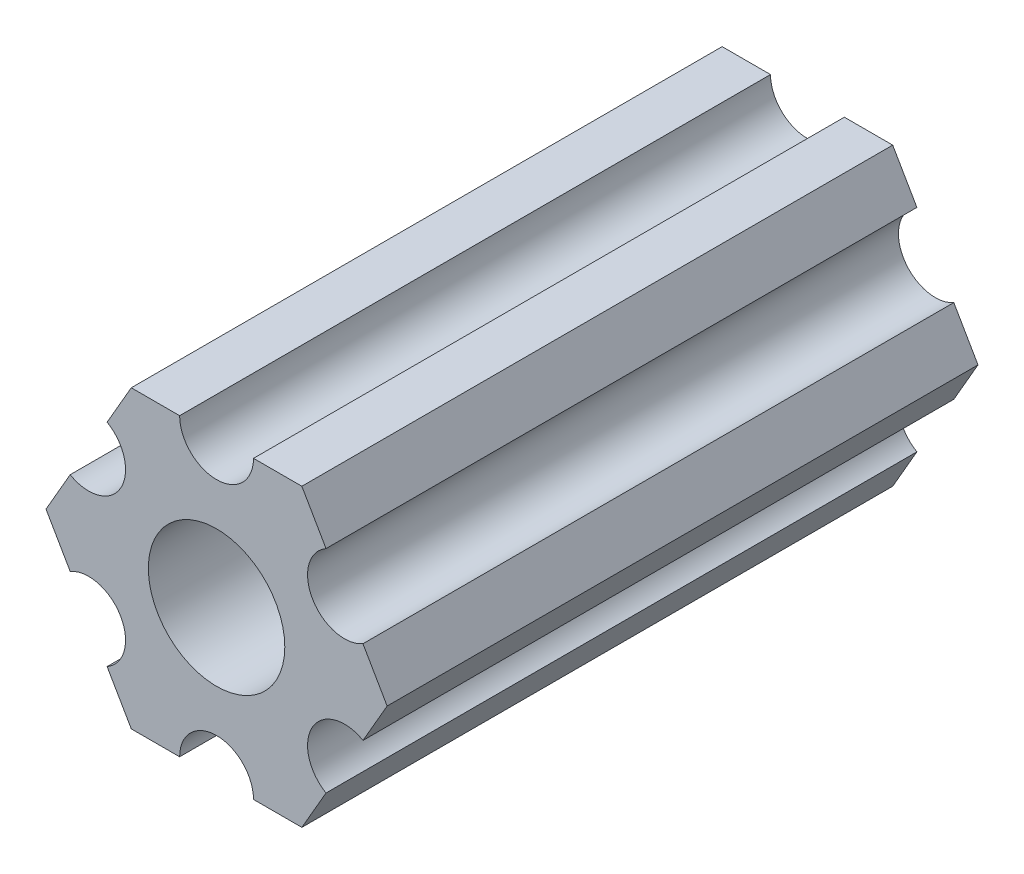
ISO-10303-21;
HEADER;
FILE_DESCRIPTION(('STEP AP214'),'2;1');
FILE_NAME('part.step','',(''),(''),'','','');
FILE_SCHEMA(('AUTOMOTIVE_DESIGN { 1 0 10303 214 1 1 1 1 }'));
ENDSEC;
DATA;
#1=APPLICATION_CONTEXT('core data for automotive mechanical design processes');
#2=APPLICATION_PROTOCOL_DEFINITION('international standard','automotive_design',2000,#1);
#3=PRODUCT_CONTEXT('',#1,'mechanical');
#4=PRODUCT('Part','Part','',(#3));
#5=PRODUCT_RELATED_PRODUCT_CATEGORY('part','',(#4));
#6=PRODUCT_DEFINITION_FORMATION('','',#4);
#7=PRODUCT_DEFINITION_CONTEXT('part definition',#1,'design');
#8=PRODUCT_DEFINITION('design','',#6,#7);
#9=PRODUCT_DEFINITION_SHAPE('','',#8);
#10=(LENGTH_UNIT() NAMED_UNIT(*) SI_UNIT(.MILLI.,.METRE.));
#11=(NAMED_UNIT(*) PLANE_ANGLE_UNIT() SI_UNIT($,.RADIAN.));
#12=(NAMED_UNIT(*) SI_UNIT($,.STERADIAN.) SOLID_ANGLE_UNIT());
#13=UNCERTAINTY_MEASURE_WITH_UNIT(LENGTH_MEASURE(1.E-05),#10,'distance_accuracy_value','');
#14=(GEOMETRIC_REPRESENTATION_CONTEXT(3) GLOBAL_UNCERTAINTY_ASSIGNED_CONTEXT((#13)) GLOBAL_UNIT_ASSIGNED_CONTEXT((#10,
#11,#12)) REPRESENTATION_CONTEXT('',''));
#15=CARTESIAN_POINT('',(0.,0.,0.));
#16=DIRECTION('',(0.,0.,1.));
#17=DIRECTION('',(1.,0.,0.));
#18=AXIS2_PLACEMENT_3D('',#15,#16,#17);
#19=CARTESIAN_POINT('',(5.49926150638083,-3.17499966684068,12.7));
#20=DIRECTION('',(0.,0.,-1.));
#21=DIRECTION('',(-1.,0.,0.));
#22=AXIS2_PLACEMENT_3D('',#19,#20,#21);
#23=CYLINDRICAL_SURFACE('',#22,1.58750000000001);
#24=CARTESIAN_POINT('',(5.49926150638083,-3.17499966684068,-12.7));
#25=DIRECTION('',(0.,0.,1.));
#26=DIRECTION('',(1.,0.,0.));
#27=AXIS2_PLACEMENT_3D('',#24,#25,#26);
#28=CIRCLE('',#27,1.58750000000001);
#29=CARTESIAN_POINT('',(6.29301142309098,-1.80018429024546,-12.7));
#30=VERTEX_POINT('',#29);
#31=CARTESIAN_POINT('',(4.70551158967068,-4.54981504343589,-12.7));
#32=VERTEX_POINT('',#31);
#33=EDGE_CURVE('E189',#30,#32,#28,.T.);
#34=ORIENTED_EDGE('',*,*,#33,.F.);
#35=DIRECTION('',(0.,0.,-1.));
#36=VECTOR('',#35,1.);
#37=CARTESIAN_POINT('',(6.29301142309098,-1.80018429024546,12.7));
#38=LINE('',#37,#36);
#39=CARTESIAN_POINT('',(6.29301142309098,-1.80018429024546,12.7));
#40=VERTEX_POINT('',#39);
#41=EDGE_CURVE('E11',#40,#30,#38,.T.);
#42=ORIENTED_EDGE('',*,*,#41,.F.);
#43=CARTESIAN_POINT('',(5.49926150638083,-3.17499966684068,12.7));
#44=DIRECTION('',(0.,0.,1.));
#45=DIRECTION('',(1.,0.,0.));
#46=AXIS2_PLACEMENT_3D('',#43,#44,#45);
#47=CIRCLE('',#46,1.58750000000001);
#48=CARTESIAN_POINT('',(4.70551158967068,-4.54981504343589,12.7));
#49=VERTEX_POINT('',#48);
#50=EDGE_CURVE('E240',#40,#49,#47,.T.);
#51=ORIENTED_EDGE('',*,*,#50,.T.);
#52=DIRECTION('',(0.,0.,-1.));
#53=VECTOR('',#52,1.);
#54=CARTESIAN_POINT('',(4.70551158967068,-4.54981504343589,12.7));
#55=LINE('',#54,#53);
#56=EDGE_CURVE('E35',#49,#32,#55,.T.);
#57=ORIENTED_EDGE('',*,*,#56,.T.);
#58=EDGE_LOOP('',(#34,#42,#51,#57));
#59=FACE_BOUND('',#58,.T.);
#60=ADVANCED_FACE('F32',(#59),#23,.F.);
#61=CARTESIAN_POINT('',(7.33234841870826,4.44212518856872E-07,12.7));
#62=DIRECTION('',(0.866025434075723,-0.499999947533953,0.));
#63=DIRECTION('',(0.499999947533953,0.866025434075723,0.));
#64=AXIS2_PLACEMENT_3D('',#61,#62,#63);
#65=PLANE('',#64);
#66=DIRECTION('',(-0.499999947533953,-0.866025434075723,0.));
#67=VECTOR('',#66,1.);
#68=CARTESIAN_POINT('',(7.33234841870826,4.44212518856872E-07,-12.7));
#69=LINE('',#68,#67);
#70=CARTESIAN_POINT('',(7.33234841870826,4.44212518856872E-07,-12.7));
#71=VERTEX_POINT('',#70);
#72=EDGE_CURVE('E238',#71,#30,#69,.T.);
#73=ORIENTED_EDGE('',*,*,#72,.F.);
#74=DIRECTION('',(0.,0.,-1.));
#75=VECTOR('',#74,1.);
#76=CARTESIAN_POINT('',(7.33234841870826,4.44212518856872E-07,12.7));
#77=LINE('',#76,#75);
#78=CARTESIAN_POINT('',(7.33234841870826,4.44212518856872E-07,12.7));
#79=VERTEX_POINT('',#78);
#80=EDGE_CURVE('E41',#79,#71,#77,.T.);
#81=ORIENTED_EDGE('',*,*,#80,.F.);
#82=DIRECTION('',(-0.499999947533953,-0.866025434075723,0.));
#83=VECTOR('',#82,1.);
#84=CARTESIAN_POINT('',(7.33234841870826,4.44212518856872E-07,12.7));
#85=LINE('',#84,#83);
#86=EDGE_CURVE('E179',#79,#40,#85,.T.);
#87=ORIENTED_EDGE('',*,*,#86,.T.);
#88=ORIENTED_EDGE('',*,*,#41,.T.);
#89=EDGE_LOOP('',(#73,#81,#87,#88));
#90=FACE_BOUND('',#89,.T.);
#91=ADVANCED_FACE('F272',(#90),#65,.T.);
#92=CARTESIAN_POINT('',(6.29301120497139,1.80018505273895,12.7));
#93=DIRECTION('',(0.866025373493145,0.500000052466056,0.));
#94=DIRECTION('',(-0.500000052466056,0.866025373493145,0.));
#95=AXIS2_PLACEMENT_3D('',#92,#93,#94);
#96=PLANE('',#95);
#97=DIRECTION('',(0.500000052466056,-0.866025373493145,0.));
#98=VECTOR('',#97,1.);
#99=CARTESIAN_POINT('',(6.29301120497139,1.80018505273895,-12.7));
#100=LINE('',#99,#98);
#101=CARTESIAN_POINT('',(6.29301120497139,1.80018505273895,-12.7));
#102=VERTEX_POINT('',#101);
#103=EDGE_CURVE('E166',#102,#71,#100,.T.);
#104=ORIENTED_EDGE('',*,*,#103,.F.);
#105=DIRECTION('',(0.,0.,-1.));
#106=VECTOR('',#105,1.);
#107=CARTESIAN_POINT('',(6.29301120497139,1.80018505273895,12.7));
#108=LINE('',#107,#106);
#109=CARTESIAN_POINT('',(6.29301120497139,1.80018505273895,12.7));
#110=VERTEX_POINT('',#109);
#111=EDGE_CURVE('E161',#110,#102,#108,.T.);
#112=ORIENTED_EDGE('',*,*,#111,.F.);
#113=DIRECTION('',(0.500000052466056,-0.866025373493145,0.));
#114=VECTOR('',#113,1.);
#115=CARTESIAN_POINT('',(6.29301120497139,1.80018505273895,12.7));
#116=LINE('',#115,#114);
#117=EDGE_CURVE('E164',#110,#79,#116,.T.);
#118=ORIENTED_EDGE('',*,*,#117,.T.);
#119=ORIENTED_EDGE('',*,*,#80,.T.);
#120=EDGE_LOOP('',(#104,#112,#118,#119));
#121=FACE_BOUND('',#120,.T.);
#122=ADVANCED_FACE('F163',(#121),#96,.T.);
#123=CARTESIAN_POINT('',(5.49926112168152,3.17500033315931,12.7));
#124=DIRECTION('',(0.,0.,-1.));
#125=DIRECTION('',(-1.,0.,0.));
#126=AXIS2_PLACEMENT_3D('',#123,#124,#125);
#127=CYLINDRICAL_SURFACE('',#126,1.5875);
#128=CARTESIAN_POINT('',(5.49926112168152,3.17500033315931,-12.7));
#129=DIRECTION('',(0.,0.,1.));
#130=DIRECTION('',(1.,0.,0.));
#131=AXIS2_PLACEMENT_3D('',#128,#129,#130);
#132=CIRCLE('',#131,1.5875);
#133=CARTESIAN_POINT('',(4.70551103839166,4.54981561357968,-12.7));
#134=VERTEX_POINT('',#133);
#135=EDGE_CURVE('E235',#134,#102,#132,.T.);
#136=ORIENTED_EDGE('',*,*,#135,.F.);
#137=DIRECTION('',(0.,0.,-1.));
#138=VECTOR('',#137,1.);
#139=CARTESIAN_POINT('',(4.70551103839166,4.54981561357968,12.7));
#140=LINE('',#139,#138);
#141=CARTESIAN_POINT('',(4.70551103839166,4.54981561357968,12.7));
#142=VERTEX_POINT('',#141);
#143=EDGE_CURVE('E171',#142,#134,#140,.T.);
#144=ORIENTED_EDGE('',*,*,#143,.F.);
#145=CARTESIAN_POINT('',(5.49926112168152,3.17500033315931,12.7));
#146=DIRECTION('',(0.,0.,1.));
#147=DIRECTION('',(1.,0.,0.));
#148=AXIS2_PLACEMENT_3D('',#145,#146,#147);
#149=CIRCLE('',#148,1.5875);
#150=EDGE_CURVE('E177',#142,#110,#149,.T.);
#151=ORIENTED_EDGE('',*,*,#150,.T.);
#152=ORIENTED_EDGE('',*,*,#111,.T.);
#153=EDGE_LOOP('',(#136,#144,#151,#152));
#154=FACE_BOUND('',#153,.T.);
#155=ADVANCED_FACE('F181',(#154),#127,.F.);
#156=CARTESIAN_POINT('',(3.66617382465472,6.35000022210622,12.7));
#157=DIRECTION('',(0.866025373493145,0.500000052466056,0.));
#158=DIRECTION('',(-0.500000052466056,0.866025373493145,0.));
#159=AXIS2_PLACEMENT_3D('',#156,#157,#158);
#160=PLANE('',#159);
#161=DIRECTION('',(0.500000052466056,-0.866025373493145,0.));
#162=VECTOR('',#161,1.);
#163=CARTESIAN_POINT('',(3.66617382465472,6.35000022210622,-12.7));
#164=LINE('',#163,#162);
#165=CARTESIAN_POINT('',(3.66617382465472,6.35000022210622,-12.7));
#166=VERTEX_POINT('',#165);
#167=EDGE_CURVE('E232',#166,#134,#164,.T.);
#168=ORIENTED_EDGE('',*,*,#167,.F.);
#169=DIRECTION('',(0.,0.,-1.));
#170=VECTOR('',#169,1.);
#171=CARTESIAN_POINT('',(3.66617382465472,6.35000022210622,12.7));
#172=LINE('',#171,#170);
#173=CARTESIAN_POINT('',(3.66617382465472,6.35000022210622,12.7));
#174=VERTEX_POINT('',#173);
#175=EDGE_CURVE('E244',#174,#166,#172,.T.);
#176=ORIENTED_EDGE('',*,*,#175,.F.);
#177=DIRECTION('',(0.500000052466056,-0.866025373493145,0.));
#178=VECTOR('',#177,1.);
#179=CARTESIAN_POINT('',(3.66617382465472,6.35000022210622,12.7));
#180=LINE('',#179,#178);
#181=EDGE_CURVE('E182',#174,#142,#180,.T.);
#182=ORIENTED_EDGE('',*,*,#181,.T.);
#183=ORIENTED_EDGE('',*,*,#143,.T.);
#184=EDGE_LOOP('',(#168,#176,#182,#183));
#185=FACE_BOUND('',#184,.T.);
#186=ADVANCED_FACE('F285',(#185),#160,.T.);
#187=CARTESIAN_POINT('',(1.58749961530066,6.35000022210623,12.7));
#188=DIRECTION('',(0.,1.,0.));
#189=DIRECTION('',(-1.,0.,0.));
#190=AXIS2_PLACEMENT_3D('',#187,#188,#189);
#191=PLANE('',#190);
#192=DIRECTION('',(1.,0.,0.));
#193=VECTOR('',#192,1.);
#194=CARTESIAN_POINT('',(1.58749961530066,6.35000022210623,-12.7));
#195=LINE('',#194,#193);
#196=CARTESIAN_POINT('',(1.58749961530066,6.35000022210623,-12.7));
#197=VERTEX_POINT('',#196);
#198=EDGE_CURVE('E229',#197,#166,#195,.T.);
#199=ORIENTED_EDGE('',*,*,#198,.F.);
#200=DIRECTION('',(0.,0.,-1.));
#201=VECTOR('',#200,1.);
#202=CARTESIAN_POINT('',(1.58749961530066,6.35000022210623,12.7));
#203=LINE('',#202,#201);
#204=CARTESIAN_POINT('',(1.58749961530066,6.35000022210623,12.7));
#205=VERTEX_POINT('',#204);
#206=EDGE_CURVE('E246',#205,#197,#203,.T.);
#207=ORIENTED_EDGE('',*,*,#206,.F.);
#208=DIRECTION('',(1.,0.,0.));
#209=VECTOR('',#208,1.);
#210=CARTESIAN_POINT('',(1.58749961530066,6.35000022210623,12.7));
#211=LINE('',#210,#209);
#212=EDGE_CURVE('E184',#205,#174,#211,.T.);
#213=ORIENTED_EDGE('',*,*,#212,.T.);
#214=ORIENTED_EDGE('',*,*,#175,.T.);
#215=EDGE_LOOP('',(#199,#207,#213,#214));
#216=FACE_BOUND('',#215,.T.);
#217=ADVANCED_FACE('F288',(#216),#191,.T.);
#218=CARTESIAN_POINT('',(-3.84699344941095E-07,6.35000022210623,12.7));
#219=DIRECTION('',(0.,0.,-1.));
#220=DIRECTION('',(-1.,0.,0.));
#221=AXIS2_PLACEMENT_3D('',#218,#219,#220);
#222=CYLINDRICAL_SURFACE('',#221,1.5875);
#223=CARTESIAN_POINT('',(-3.84699344941095E-07,6.35000022210623,-12.7));
#224=DIRECTION('',(0.,0.,1.));
#225=DIRECTION('',(1.,0.,0.));
#226=AXIS2_PLACEMENT_3D('',#223,#224,#225);
#227=CIRCLE('',#226,1.5875);
#228=CARTESIAN_POINT('',(-1.58750038469935,6.35000022210623,-12.7));
#229=VERTEX_POINT('',#228);
#230=EDGE_CURVE('E226',#229,#197,#227,.T.);
#231=ORIENTED_EDGE('',*,*,#230,.F.);
#232=DIRECTION('',(0.,0.,-1.));
#233=VECTOR('',#232,1.);
#234=CARTESIAN_POINT('',(-1.58750038469935,6.35000022210623,12.7));
#235=LINE('',#234,#233);
#236=CARTESIAN_POINT('',(-1.58750038469935,6.35000022210623,12.7));
#237=VERTEX_POINT('',#236);
#238=EDGE_CURVE('E248',#237,#229,#235,.T.);
#239=ORIENTED_EDGE('',*,*,#238,.F.);
#240=CARTESIAN_POINT('',(-3.84699344941095E-07,6.35000022210623,12.7));
#241=DIRECTION('',(0.,0.,1.));
#242=DIRECTION('',(1.,0.,0.));
#243=AXIS2_PLACEMENT_3D('',#240,#241,#242);
#244=CIRCLE('',#243,1.5875);
#245=EDGE_CURVE('E393',#237,#205,#244,.T.);
#246=ORIENTED_EDGE('',*,*,#245,.T.);
#247=ORIENTED_EDGE('',*,*,#206,.T.);
#248=EDGE_LOOP('',(#231,#239,#246,#247));
#249=FACE_BOUND('',#248,.T.);
#250=ADVANCED_FACE('F292',(#249),#222,.F.);
#251=CARTESIAN_POINT('',(-3.66617452134701,6.35000022210623,12.7));
#252=DIRECTION('',(0.,1.,0.));
#253=DIRECTION('',(0.,0.,1.));
#254=AXIS2_PLACEMENT_3D('',#251,#252,#253);
#255=PLANE('',#254);
#256=DIRECTION('',(1.,0.,0.));
#257=VECTOR('',#256,1.);
#258=CARTESIAN_POINT('',(-3.66617452134701,6.35000022210623,-12.7));
#259=LINE('',#258,#257);
#260=CARTESIAN_POINT('',(-3.66617452134701,6.35000022210623,-12.7));
#261=VERTEX_POINT('',#260);
#262=EDGE_CURVE('E223',#261,#229,#259,.T.);
#263=ORIENTED_EDGE('',*,*,#262,.F.);
#264=DIRECTION('',(0.,0.,-1.));
#265=VECTOR('',#264,1.);
#266=CARTESIAN_POINT('',(-3.66617452134701,6.35000022210623,12.7));
#267=LINE('',#266,#265);
#268=CARTESIAN_POINT('',(-3.66617452134701,6.35000022210623,12.7));
#269=VERTEX_POINT('',#268);
#270=EDGE_CURVE('E250',#269,#261,#267,.T.);
#271=ORIENTED_EDGE('',*,*,#270,.F.);
#272=DIRECTION('',(1.,0.,0.));
#273=VECTOR('',#272,1.);
#274=CARTESIAN_POINT('',(-3.66617452134701,6.35000022210623,12.7));
#275=LINE('',#274,#273);
#276=EDGE_CURVE('E390',#269,#237,#275,.T.);
#277=ORIENTED_EDGE('',*,*,#276,.T.);
#278=ORIENTED_EDGE('',*,*,#238,.T.);
#279=EDGE_LOOP('',(#263,#271,#277,#278));
#280=FACE_BOUND('',#279,.T.);
#281=ADVANCED_FACE('F296',(#280),#255,.T.);
#282=CARTESIAN_POINT('',(-4.70551145677116,4.54981548085265,12.7));
#283=DIRECTION('',(-0.866025447431971,0.499999924400249,0.));
#284=DIRECTION('',(-0.499999924400249,-0.866025447431971,0.));
#285=AXIS2_PLACEMENT_3D('',#282,#283,#284);
#286=PLANE('',#285);
#287=DIRECTION('',(0.499999924400249,0.866025447431971,0.));
#288=VECTOR('',#287,1.);
#289=CARTESIAN_POINT('',(-4.70551145677116,4.54981548085265,-12.7));
#290=LINE('',#289,#288);
#291=CARTESIAN_POINT('',(-4.70551145677116,4.54981548085265,-12.7));
#292=VERTEX_POINT('',#291);
#293=EDGE_CURVE('E220',#292,#261,#290,.T.);
#294=ORIENTED_EDGE('',*,*,#293,.F.);
#295=DIRECTION('',(0.,0.,-1.));
#296=VECTOR('',#295,1.);
#297=CARTESIAN_POINT('',(-4.70551145677116,4.54981548085265,12.7));
#298=LINE('',#297,#296);
#299=CARTESIAN_POINT('',(-4.70551145677116,4.54981548085265,12.7));
#300=VERTEX_POINT('',#299);
#301=EDGE_CURVE('E252',#300,#292,#298,.T.);
#302=ORIENTED_EDGE('',*,*,#301,.F.);
#303=DIRECTION('',(0.499999924400249,0.866025447431971,0.));
#304=VECTOR('',#303,1.);
#305=CARTESIAN_POINT('',(-4.70551145677116,4.54981548085265,12.7));
#306=LINE('',#305,#304);
#307=EDGE_CURVE('E387',#300,#269,#306,.T.);
#308=ORIENTED_EDGE('',*,*,#307,.T.);
#309=ORIENTED_EDGE('',*,*,#270,.T.);
#310=EDGE_LOOP('',(#294,#302,#308,#309));
#311=FACE_BOUND('',#310,.T.);
#312=ADVANCED_FACE('F300',(#311),#286,.T.);
#313=CARTESIAN_POINT('',(-5.49926133675655,3.17500008305439,12.7));
#314=DIRECTION('',(0.,0.,-1.));
#315=DIRECTION('',(-1.,0.,0.));
#316=AXIS2_PLACEMENT_3D('',#313,#314,#315);
#317=CYLINDRICAL_SURFACE('',#316,1.5875);
#318=CARTESIAN_POINT('',(-5.49926133675655,3.17500008305439,-12.7));
#319=DIRECTION('',(0.,0.,1.));
#320=DIRECTION('',(1.,0.,0.));
#321=AXIS2_PLACEMENT_3D('',#318,#319,#320);
#322=CIRCLE('',#321,1.5875);
#323=CARTESIAN_POINT('',(-6.29301121674195,1.80018468525613,-12.7));
#324=VERTEX_POINT('',#323);
#325=EDGE_CURVE('E217',#324,#292,#322,.T.);
#326=ORIENTED_EDGE('',*,*,#325,.F.);
#327=DIRECTION('',(0.,0.,-1.));
#328=VECTOR('',#327,1.);
#329=CARTESIAN_POINT('',(-6.29301121674195,1.80018468525613,12.7));
#330=LINE('',#329,#328);
#331=CARTESIAN_POINT('',(-6.29301121674195,1.80018468525613,12.7));
#332=VERTEX_POINT('',#331);
#333=EDGE_CURVE('E254',#332,#324,#330,.T.);
#334=ORIENTED_EDGE('',*,*,#333,.F.);
#335=CARTESIAN_POINT('',(-5.49926133675655,3.17500008305439,12.7));
#336=DIRECTION('',(0.,0.,1.));
#337=DIRECTION('',(1.,0.,0.));
#338=AXIS2_PLACEMENT_3D('',#335,#336,#337);
#339=CIRCLE('',#338,1.5875);
#340=EDGE_CURVE('E384',#332,#300,#339,.T.);
#341=ORIENTED_EDGE('',*,*,#340,.T.);
#342=ORIENTED_EDGE('',*,*,#301,.T.);
#343=EDGE_LOOP('',(#326,#334,#341,#342));
#344=FACE_BOUND('',#343,.T.);
#345=ADVANCED_FACE('F304',(#344),#317,.F.);
#346=CARTESIAN_POINT('',(-7.33234807945963,6.99338729030344E-08,12.7));
#347=DIRECTION('',(-0.866025447431971,0.499999924400249,0.));
#348=DIRECTION('',(-0.499999924400249,-0.866025447431971,0.));
#349=AXIS2_PLACEMENT_3D('',#346,#347,#348);
#350=PLANE('',#349);
#351=DIRECTION('',(0.499999924400249,0.866025447431971,0.));
#352=VECTOR('',#351,1.);
#353=CARTESIAN_POINT('',(-7.33234807945963,6.99338729030344E-08,-12.7));
#354=LINE('',#353,#352);
#355=CARTESIAN_POINT('',(-7.33234807945963,6.99338729030344E-08,-12.7));
#356=VERTEX_POINT('',#355);
#357=EDGE_CURVE('E214',#356,#324,#354,.T.);
#358=ORIENTED_EDGE('',*,*,#357,.F.);
#359=DIRECTION('',(0.,0.,-1.));
#360=VECTOR('',#359,1.);
#361=CARTESIAN_POINT('',(-7.33234807945963,6.99338729030344E-08,12.7));
#362=LINE('',#361,#360);
#363=CARTESIAN_POINT('',(-7.33234807945963,6.99338729030344E-08,12.7));
#364=VERTEX_POINT('',#363);
#365=EDGE_CURVE('E256',#364,#356,#362,.T.);
#366=ORIENTED_EDGE('',*,*,#365,.F.);
#367=DIRECTION('',(0.499999924400249,0.866025447431971,0.));
#368=VECTOR('',#367,1.);
#369=CARTESIAN_POINT('',(-7.33234807945963,6.99338729030344E-08,12.7));
#370=LINE('',#369,#368);
#371=EDGE_CURVE('E381',#364,#332,#370,.T.);
#372=ORIENTED_EDGE('',*,*,#371,.T.);
#373=ORIENTED_EDGE('',*,*,#333,.T.);
#374=EDGE_LOOP('',(#358,#366,#372,#373));
#375=FACE_BOUND('',#374,.T.);
#376=ADVANCED_FACE('F308',(#375),#350,.T.);
#377=CARTESIAN_POINT('',(-6.29301096189761,-1.80018459411914,12.7));
#378=DIRECTION('',(-0.866025400205645,-0.500000006198653,0.));
#379=DIRECTION('',(0.500000006198653,-0.866025400205645,0.));
#380=AXIS2_PLACEMENT_3D('',#377,#378,#379);
#381=PLANE('',#380);
#382=DIRECTION('',(-0.500000006198653,0.866025400205645,0.));
#383=VECTOR('',#382,1.);
#384=CARTESIAN_POINT('',(-6.29301096189761,-1.80018459411914,-12.7));
#385=LINE('',#384,#383);
#386=CARTESIAN_POINT('',(-6.29301096189761,-1.80018459411914,-12.7));
#387=VERTEX_POINT('',#386);
#388=EDGE_CURVE('E211',#387,#356,#385,.T.);
#389=ORIENTED_EDGE('',*,*,#388,.F.);
#390=DIRECTION('',(0.,0.,-1.));
#391=VECTOR('',#390,1.);
#392=CARTESIAN_POINT('',(-6.29301096189761,-1.80018459411914,12.7));
#393=LINE('',#392,#391);
#394=CARTESIAN_POINT('',(-6.29301096189761,-1.80018459411914,12.7));
#395=VERTEX_POINT('',#394);
#396=EDGE_CURVE('E258',#395,#387,#393,.T.);
#397=ORIENTED_EDGE('',*,*,#396,.F.);
#398=DIRECTION('',(-0.500000006198653,0.866025400205645,0.));
#399=VECTOR('',#398,1.);
#400=CARTESIAN_POINT('',(-6.29301096189761,-1.80018459411914,12.7));
#401=LINE('',#400,#399);
#402=EDGE_CURVE('E378',#395,#364,#401,.T.);
#403=ORIENTED_EDGE('',*,*,#402,.T.);
#404=ORIENTED_EDGE('',*,*,#365,.T.);
#405=EDGE_LOOP('',(#389,#397,#403,#404));
#406=FACE_BOUND('',#405,.T.);
#407=ADVANCED_FACE('F312',(#406),#381,.T.);
#408=CARTESIAN_POINT('',(-5.49926095205725,-3.1749999169456,12.7));
#409=DIRECTION('',(0.,0.,-1.));
#410=DIRECTION('',(-1.,0.,0.));
#411=AXIS2_PLACEMENT_3D('',#408,#409,#410);
#412=CYLINDRICAL_SURFACE('',#411,1.5875);
#413=CARTESIAN_POINT('',(-5.49926095205725,-3.1749999169456,-12.7));
#414=DIRECTION('',(0.,0.,1.));
#415=DIRECTION('',(1.,0.,0.));
#416=AXIS2_PLACEMENT_3D('',#413,#414,#415);
#417=CIRCLE('',#416,1.5875);
#418=CARTESIAN_POINT('',(-4.70551094221689,-4.54981523977206,-12.7));
#419=VERTEX_POINT('',#418);
#420=EDGE_CURVE('E208',#419,#387,#417,.T.);
#421=ORIENTED_EDGE('',*,*,#420,.F.);
#422=DIRECTION('',(0.,0.,-1.));
#423=VECTOR('',#422,1.);
#424=CARTESIAN_POINT('',(-4.70551094221689,-4.54981523977206,12.7));
#425=LINE('',#424,#423);
#426=CARTESIAN_POINT('',(-4.70551094221689,-4.54981523977206,12.7));
#427=VERTEX_POINT('',#426);
#428=EDGE_CURVE('E260',#427,#419,#425,.T.);
#429=ORIENTED_EDGE('',*,*,#428,.F.);
#430=CARTESIAN_POINT('',(-5.49926095205725,-3.1749999169456,12.7));
#431=DIRECTION('',(0.,0.,1.));
#432=DIRECTION('',(1.,0.,0.));
#433=AXIS2_PLACEMENT_3D('',#430,#431,#432);
#434=CIRCLE('',#433,1.5875);
#435=EDGE_CURVE('E375',#427,#395,#434,.T.);
#436=ORIENTED_EDGE('',*,*,#435,.T.);
#437=ORIENTED_EDGE('',*,*,#396,.T.);
#438=EDGE_LOOP('',(#421,#429,#436,#437));
#439=FACE_BOUND('',#438,.T.);
#440=ADVANCED_FACE('F316',(#439),#412,.F.);
#441=CARTESIAN_POINT('',(-3.66617382465481,-6.34999990382519,12.7));
#442=DIRECTION('',(-0.866025400205644,-0.500000006198653,0.));
#443=DIRECTION('',(0.500000006198653,-0.866025400205645,0.));
#444=AXIS2_PLACEMENT_3D('',#441,#442,#443);
#445=PLANE('',#444);
#446=DIRECTION('',(-0.500000006198653,0.866025400205644,0.));
#447=VECTOR('',#446,1.);
#448=CARTESIAN_POINT('',(-3.66617382465481,-6.34999990382519,-12.7));
#449=LINE('',#448,#447);
#450=CARTESIAN_POINT('',(-3.66617382465481,-6.34999990382519,-12.7));
#451=VERTEX_POINT('',#450);
#452=EDGE_CURVE('E205',#451,#419,#449,.T.);
#453=ORIENTED_EDGE('',*,*,#452,.F.);
#454=DIRECTION('',(0.,0.,-1.));
#455=VECTOR('',#454,1.);
#456=CARTESIAN_POINT('',(-3.66617382465481,-6.34999990382519,12.7));
#457=LINE('',#456,#455);
#458=CARTESIAN_POINT('',(-3.66617382465481,-6.34999990382519,12.7));
#459=VERTEX_POINT('',#458);
#460=EDGE_CURVE('E262',#459,#451,#457,.T.);
#461=ORIENTED_EDGE('',*,*,#460,.F.);
#462=DIRECTION('',(-0.500000006198653,0.866025400205644,0.));
#463=VECTOR('',#462,1.);
#464=CARTESIAN_POINT('',(-3.66617382465481,-6.34999990382519,12.7));
#465=LINE('',#464,#463);
#466=EDGE_CURVE('E372',#459,#427,#465,.T.);
#467=ORIENTED_EDGE('',*,*,#466,.T.);
#468=ORIENTED_EDGE('',*,*,#428,.T.);
#469=EDGE_LOOP('',(#453,#461,#467,#468));
#470=FACE_BOUND('',#469,.T.);
#471=ADVANCED_FACE('F320',(#470),#445,.T.);
#472=CARTESIAN_POINT('',(-1.58749961530074,-6.34999990382519,12.7));
#473=DIRECTION('',(0.,-1.,0.));
#474=DIRECTION('',(1.,0.,0.));
#475=AXIS2_PLACEMENT_3D('',#472,#473,#474);
#476=PLANE('',#475);
#477=DIRECTION('',(-1.,0.,0.));
#478=VECTOR('',#477,1.);
#479=CARTESIAN_POINT('',(-1.58749961530074,-6.34999990382519,-12.7));
#480=LINE('',#479,#478);
#481=CARTESIAN_POINT('',(-1.58749961530074,-6.34999990382519,-12.7));
#482=VERTEX_POINT('',#481);
#483=EDGE_CURVE('E202',#482,#451,#480,.T.);
#484=ORIENTED_EDGE('',*,*,#483,.F.);
#485=DIRECTION('',(0.,0.,-1.));
#486=VECTOR('',#485,1.);
#487=CARTESIAN_POINT('',(-1.58749961530074,-6.34999990382519,12.7));
#488=LINE('',#487,#486);
#489=CARTESIAN_POINT('',(-1.58749961530074,-6.34999990382519,12.7));
#490=VERTEX_POINT('',#489);
#491=EDGE_CURVE('E264',#490,#482,#488,.T.);
#492=ORIENTED_EDGE('',*,*,#491,.F.);
#493=DIRECTION('',(-1.,0.,0.));
#494=VECTOR('',#493,1.);
#495=CARTESIAN_POINT('',(-1.58749961530074,-6.34999990382519,12.7));
#496=LINE('',#495,#494);
#497=EDGE_CURVE('E369',#490,#459,#496,.T.);
#498=ORIENTED_EDGE('',*,*,#497,.T.);
#499=ORIENTED_EDGE('',*,*,#460,.T.);
#500=EDGE_LOOP('',(#484,#492,#498,#499));
#501=FACE_BOUND('',#500,.T.);
#502=ADVANCED_FACE('F324',(#501),#476,.T.);
#503=CARTESIAN_POINT('',(3.8469926204343E-07,-6.34999990382519,12.7));
#504=DIRECTION('',(0.,0.,-1.));
#505=DIRECTION('',(-1.,0.,0.));
#506=AXIS2_PLACEMENT_3D('',#503,#504,#505);
#507=CYLINDRICAL_SURFACE('',#506,1.5875);
#508=CARTESIAN_POINT('',(3.8469926204343E-07,-6.34999990382519,-12.7));
#509=DIRECTION('',(0.,0.,1.));
#510=DIRECTION('',(1.,0.,0.));
#511=AXIS2_PLACEMENT_3D('',#508,#509,#510);
#512=CIRCLE('',#511,1.5875);
#513=CARTESIAN_POINT('',(1.58750038469926,-6.34999990382518,-12.7));
#514=VERTEX_POINT('',#513);
#515=EDGE_CURVE('E199',#514,#482,#512,.T.);
#516=ORIENTED_EDGE('',*,*,#515,.F.);
#517=DIRECTION('',(0.,0.,-1.));
#518=VECTOR('',#517,1.);
#519=CARTESIAN_POINT('',(1.58750038469926,-6.34999990382518,12.7));
#520=LINE('',#519,#518);
#521=CARTESIAN_POINT('',(1.58750038469926,-6.34999990382518,12.7));
#522=VERTEX_POINT('',#521);
#523=EDGE_CURVE('E266',#522,#514,#520,.T.);
#524=ORIENTED_EDGE('',*,*,#523,.F.);
#525=CARTESIAN_POINT('',(3.8469926204343E-07,-6.34999990382519,12.7));
#526=DIRECTION('',(0.,0.,1.));
#527=DIRECTION('',(1.,0.,0.));
#528=AXIS2_PLACEMENT_3D('',#525,#526,#527);
#529=CIRCLE('',#528,1.5875);
#530=EDGE_CURVE('E366',#522,#490,#529,.T.);
#531=ORIENTED_EDGE('',*,*,#530,.T.);
#532=ORIENTED_EDGE('',*,*,#491,.T.);
#533=EDGE_LOOP('',(#516,#524,#531,#532));
#534=FACE_BOUND('',#533,.T.);
#535=ADVANCED_FACE('F328',(#534),#507,.F.);
#536=CARTESIAN_POINT('',(3.66617452134693,-6.34999990382519,12.7));
#537=DIRECTION('',(0.,-1.,0.));
#538=DIRECTION('',(1.,0.,0.));
#539=AXIS2_PLACEMENT_3D('',#536,#537,#538);
#540=PLANE('',#539);
#541=DIRECTION('',(-1.,0.,0.));
#542=VECTOR('',#541,1.);
#543=CARTESIAN_POINT('',(3.66617452134693,-6.34999990382519,-12.7));
#544=LINE('',#543,#542);
#545=CARTESIAN_POINT('',(3.66617452134693,-6.34999990382519,-12.7));
#546=VERTEX_POINT('',#545);
#547=EDGE_CURVE('E196',#546,#514,#544,.T.);
#548=ORIENTED_EDGE('',*,*,#547,.F.);
#549=DIRECTION('',(0.,0.,-1.));
#550=VECTOR('',#549,1.);
#551=CARTESIAN_POINT('',(3.66617452134693,-6.34999990382519,12.7));
#552=LINE('',#551,#550);
#553=CARTESIAN_POINT('',(3.66617452134693,-6.34999990382519,12.7));
#554=VERTEX_POINT('',#553);
#555=EDGE_CURVE('E267',#554,#546,#552,.T.);
#556=ORIENTED_EDGE('',*,*,#555,.F.);
#557=DIRECTION('',(-1.,0.,0.));
#558=VECTOR('',#557,1.);
#559=CARTESIAN_POINT('',(3.66617452134693,-6.34999990382519,12.7));
#560=LINE('',#559,#558);
#561=EDGE_CURVE('E363',#554,#522,#560,.T.);
#562=ORIENTED_EDGE('',*,*,#561,.T.);
#563=ORIENTED_EDGE('',*,*,#523,.T.);
#564=EDGE_LOOP('',(#548,#556,#562,#563));
#565=FACE_BOUND('',#564,.T.);
#566=ADVANCED_FACE('F332',(#565),#540,.T.);
#567=CARTESIAN_POINT('',(4.70551158967068,-4.54981504343589,12.7));
#568=DIRECTION('',(0.866025434075723,-0.499999947533953,0.));
#569=DIRECTION('',(0.499999947533953,0.866025434075723,0.));
#570=AXIS2_PLACEMENT_3D('',#567,#568,#569);
#571=PLANE('',#570);
#572=DIRECTION('',(-0.499999947533953,-0.866025434075723,0.));
#573=VECTOR('',#572,1.);
#574=CARTESIAN_POINT('',(4.70551158967068,-4.54981504343589,-12.7));
#575=LINE('',#574,#573);
#576=EDGE_CURVE('E192',#32,#546,#575,.T.);
#577=ORIENTED_EDGE('',*,*,#576,.F.);
#578=ORIENTED_EDGE('',*,*,#56,.F.);
#579=DIRECTION('',(-0.499999947533953,-0.866025434075723,0.));
#580=VECTOR('',#579,1.);
#581=CARTESIAN_POINT('',(4.70551158967068,-4.54981504343589,12.7));
#582=LINE('',#581,#580);
#583=EDGE_CURVE('E361',#49,#554,#582,.T.);
#584=ORIENTED_EDGE('',*,*,#583,.T.);
#585=ORIENTED_EDGE('',*,*,#555,.T.);
#586=EDGE_LOOP('',(#577,#578,#584,#585));
#587=FACE_BOUND('',#586,.T.);
#588=ADVANCED_FACE('F269',(#587),#571,.T.);
#589=CARTESIAN_POINT('',(5.49926150638083,-3.17499966684068,12.7));
#590=DIRECTION('',(0.,0.,1.));
#591=DIRECTION('',(1.,0.,0.));
#592=AXIS2_PLACEMENT_3D('',#589,#590,#591);
#593=PLANE('',#592);
#594=CARTESIAN_POINT('',(0.,0.,12.7));
#595=DIRECTION('',(0.,0.,-1.));
#596=DIRECTION('',(1.,0.,0.));
#597=AXIS2_PLACEMENT_3D('',#594,#595,#596);
#598=CIRCLE('',#597,2.9337);
#599=CARTESIAN_POINT('',(2.9337,0.,12.7));
#600=VERTEX_POINT('',#599);
#601=EDGE_CURVE('E193',#600,#600,#598,.T.);
#602=ORIENTED_EDGE('',*,*,#601,.T.);
#603=EDGE_LOOP('',(#602));
#604=FACE_BOUND('',#603,.T.);
#605=ORIENTED_EDGE('',*,*,#50,.F.);
#606=ORIENTED_EDGE('',*,*,#86,.F.);
#607=ORIENTED_EDGE('',*,*,#117,.F.);
#608=ORIENTED_EDGE('',*,*,#150,.F.);
#609=ORIENTED_EDGE('',*,*,#181,.F.);
#610=ORIENTED_EDGE('',*,*,#212,.F.);
#611=ORIENTED_EDGE('',*,*,#245,.F.);
#612=ORIENTED_EDGE('',*,*,#276,.F.);
#613=ORIENTED_EDGE('',*,*,#307,.F.);
#614=ORIENTED_EDGE('',*,*,#340,.F.);
#615=ORIENTED_EDGE('',*,*,#371,.F.);
#616=ORIENTED_EDGE('',*,*,#402,.F.);
#617=ORIENTED_EDGE('',*,*,#435,.F.);
#618=ORIENTED_EDGE('',*,*,#466,.F.);
#619=ORIENTED_EDGE('',*,*,#497,.F.);
#620=ORIENTED_EDGE('',*,*,#530,.F.);
#621=ORIENTED_EDGE('',*,*,#561,.F.);
#622=ORIENTED_EDGE('',*,*,#583,.F.);
#623=EDGE_LOOP('',(#605,#606,#607,#608,#609,#610,#611,#612,#613,#614,#615,#616,#617,#618,#619,
#620,#621,#622));
#624=FACE_BOUND('',#623,.T.);
#625=ADVANCED_FACE('F175',(#604,#624),#593,.T.);
#626=CARTESIAN_POINT('',(5.49926150638083,-3.17499966684068,-12.7));
#627=DIRECTION('',(0.,0.,1.));
#628=DIRECTION('',(1.,0.,0.));
#629=AXIS2_PLACEMENT_3D('',#626,#627,#628);
#630=PLANE('',#629);
#631=CARTESIAN_POINT('',(0.,0.,-12.7));
#632=DIRECTION('',(0.,0.,-1.));
#633=DIRECTION('',(1.,0.,0.));
#634=AXIS2_PLACEMENT_3D('',#631,#632,#633);
#635=CIRCLE('',#634,2.9337);
#636=CARTESIAN_POINT('',(2.9337,0.,-12.7));
#637=VERTEX_POINT('',#636);
#638=EDGE_CURVE('E356',#637,#637,#635,.T.);
#639=ORIENTED_EDGE('',*,*,#638,.F.);
#640=EDGE_LOOP('',(#639));
#641=FACE_BOUND('',#640,.T.);
#642=ORIENTED_EDGE('',*,*,#33,.T.);
#643=ORIENTED_EDGE('',*,*,#576,.T.);
#644=ORIENTED_EDGE('',*,*,#547,.T.);
#645=ORIENTED_EDGE('',*,*,#515,.T.);
#646=ORIENTED_EDGE('',*,*,#483,.T.);
#647=ORIENTED_EDGE('',*,*,#452,.T.);
#648=ORIENTED_EDGE('',*,*,#420,.T.);
#649=ORIENTED_EDGE('',*,*,#388,.T.);
#650=ORIENTED_EDGE('',*,*,#357,.T.);
#651=ORIENTED_EDGE('',*,*,#325,.T.);
#652=ORIENTED_EDGE('',*,*,#293,.T.);
#653=ORIENTED_EDGE('',*,*,#262,.T.);
#654=ORIENTED_EDGE('',*,*,#230,.T.);
#655=ORIENTED_EDGE('',*,*,#198,.T.);
#656=ORIENTED_EDGE('',*,*,#167,.T.);
#657=ORIENTED_EDGE('',*,*,#135,.T.);
#658=ORIENTED_EDGE('',*,*,#103,.T.);
#659=ORIENTED_EDGE('',*,*,#72,.T.);
#660=EDGE_LOOP('',(#642,#643,#644,#645,#646,#647,#648,#649,#650,#651,#652,#653,#654,#655,#656,
#657,#658,#659));
#661=FACE_BOUND('',#660,.T.);
#662=ADVANCED_FACE('F271',(#641,#661),#630,.F.);
#663=CARTESIAN_POINT('',(0.,0.,12.7));
#664=DIRECTION('',(0.,0.,-1.));
#665=DIRECTION('',(-1.,0.,0.));
#666=AXIS2_PLACEMENT_3D('',#663,#664,#665);
#667=CYLINDRICAL_SURFACE('',#666,2.9337);
#668=ORIENTED_EDGE('',*,*,#601,.F.);
#669=EDGE_LOOP('',(#668));
#670=FACE_BOUND('',#669,.T.);
#671=ORIENTED_EDGE('',*,*,#638,.T.);
#672=EDGE_LOOP('',(#671));
#673=FACE_BOUND('',#672,.T.);
#674=ADVANCED_FACE('F344',(#670,#673),#667,.F.);
#675=CLOSED_SHELL('',(#60,#91,#122,#155,#186,#217,#250,#281,#312,#345,#376,#407,#440,#471,#502,
#535,#566,#588,#625,#662,#674));
#676=MANIFOLD_SOLID_BREP('B2',#675);
#677=ADVANCED_BREP_SHAPE_REPRESENTATION('',(#18,#676),#14);
#678=SHAPE_DEFINITION_REPRESENTATION(#9,#677);
ENDSEC;
END-ISO-10303-21;
